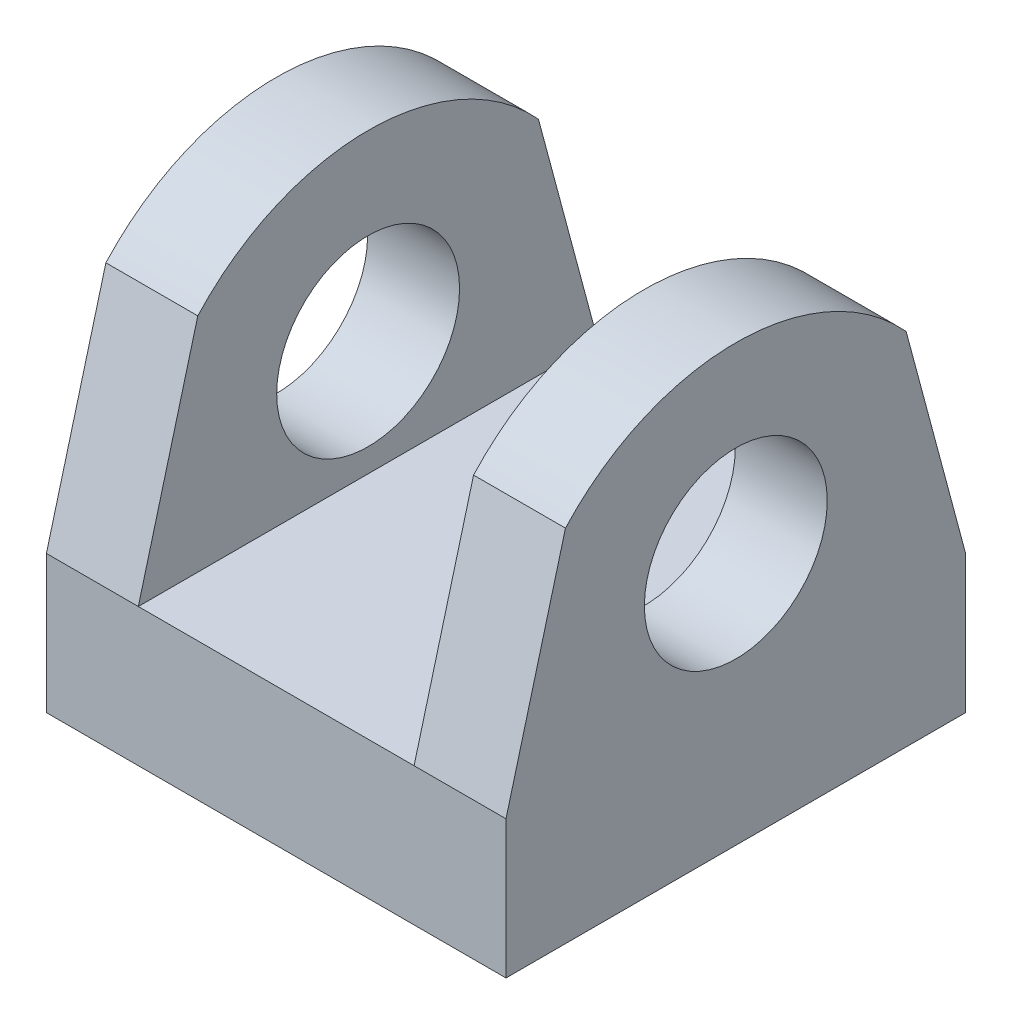
ISO-10303-21;
HEADER;
FILE_DESCRIPTION(('STEP AP214'),'2;1');
FILE_NAME('part.step','',(''),(''),'','','');
FILE_SCHEMA(('AUTOMOTIVE_DESIGN { 1 0 10303 214 1 1 1 1 }'));
ENDSEC;
DATA;
#1=APPLICATION_CONTEXT('core data for automotive mechanical design processes');
#2=APPLICATION_PROTOCOL_DEFINITION('international standard','automotive_design',2000,#1);
#3=PRODUCT_CONTEXT('',#1,'mechanical');
#4=PRODUCT('Part','Part','',(#3));
#5=PRODUCT_RELATED_PRODUCT_CATEGORY('part','',(#4));
#6=PRODUCT_DEFINITION_FORMATION('','',#4);
#7=PRODUCT_DEFINITION_CONTEXT('part definition',#1,'design');
#8=PRODUCT_DEFINITION('design','',#6,#7);
#9=PRODUCT_DEFINITION_SHAPE('','',#8);
#10=(LENGTH_UNIT() NAMED_UNIT(*) SI_UNIT(.MILLI.,.METRE.));
#11=(NAMED_UNIT(*) PLANE_ANGLE_UNIT() SI_UNIT($,.RADIAN.));
#12=(NAMED_UNIT(*) SI_UNIT($,.STERADIAN.) SOLID_ANGLE_UNIT());
#13=UNCERTAINTY_MEASURE_WITH_UNIT(LENGTH_MEASURE(1.E-05),#10,'distance_accuracy_value','');
#14=(GEOMETRIC_REPRESENTATION_CONTEXT(3) GLOBAL_UNCERTAINTY_ASSIGNED_CONTEXT((#13)) GLOBAL_UNIT_ASSIGNED_CONTEXT((#10,
#11,#12)) REPRESENTATION_CONTEXT('',''));
#15=CARTESIAN_POINT('',(0.,0.,0.));
#16=DIRECTION('',(0.,0.,1.));
#17=DIRECTION('',(1.,0.,0.));
#18=AXIS2_PLACEMENT_3D('',#15,#16,#17);
#19=CARTESIAN_POINT('',(12.7,7.62,12.7));
#20=DIRECTION('',(-1.,0.,0.));
#21=DIRECTION('',(0.,0.,1.));
#22=AXIS2_PLACEMENT_3D('',#19,#20,#21);
#23=PLANE('',#22);
#24=CARTESIAN_POINT('',(12.7,13.97,0.));
#25=DIRECTION('',(1.,0.,0.));
#26=DIRECTION('',(0.,0.,-1.));
#27=AXIS2_PLACEMENT_3D('',#24,#25,#26);
#28=CIRCLE('',#27,5.05316944316768);
#29=CARTESIAN_POINT('',(12.7,13.97,-5.05316944316768));
#30=VERTEX_POINT('',#29);
#31=EDGE_CURVE('E245',#30,#30,#28,.T.);
#32=ORIENTED_EDGE('',*,*,#31,.F.);
#33=EDGE_LOOP('',(#32));
#34=FACE_BOUND('',#33,.T.);
#35=DIRECTION('',(0.,0.,-1.));
#36=VECTOR('',#35,1.);
#37=CARTESIAN_POINT('',(12.7,0.,12.7));
#38=LINE('',#37,#36);
#39=CARTESIAN_POINT('',(12.7,0.,12.7));
#40=VERTEX_POINT('',#39);
#41=CARTESIAN_POINT('',(12.7,0.,-12.7));
#42=VERTEX_POINT('',#41);
#43=EDGE_CURVE('E172',#40,#42,#38,.T.);
#44=ORIENTED_EDGE('',*,*,#43,.T.);
#45=DIRECTION('',(0.,-1.,0.));
#46=VECTOR('',#45,1.);
#47=CARTESIAN_POINT('',(12.7,7.62,-12.7));
#48=LINE('',#47,#46);
#49=CARTESIAN_POINT('',(12.7,7.62,-12.7));
#50=VERTEX_POINT('',#49);
#51=EDGE_CURVE('E11',#50,#42,#48,.T.);
#52=ORIENTED_EDGE('',*,*,#51,.F.);
#53=DIRECTION('',(0.,0.965925826289067,0.258819045102525));
#54=VECTOR('',#53,1.);
#55=CARTESIAN_POINT('',(12.7,7.62,-12.7));
#56=LINE('',#55,#54);
#57=CARTESIAN_POINT('',(12.7,19.8872579938712,-9.41299812719793));
#58=VERTEX_POINT('',#57);
#59=EDGE_CURVE('E147',#50,#58,#56,.T.);
#60=ORIENTED_EDGE('',*,*,#59,.T.);
#61=CARTESIAN_POINT('',(12.7,11.3461568597658,0.));
#62=DIRECTION('',(1.,0.,0.));
#63=DIRECTION('',(0.,0.,1.));
#64=AXIS2_PLACEMENT_3D('',#61,#62,#63);
#65=CIRCLE('',#64,12.7104265202097);
#66=CARTESIAN_POINT('',(12.7,19.8872579938712,9.41299812719802));
#67=VERTEX_POINT('',#66);
#68=EDGE_CURVE('E165',#58,#67,#65,.T.);
#69=ORIENTED_EDGE('',*,*,#68,.T.);
#70=DIRECTION('',(0.,-0.965925826289069,0.258819045102518));
#71=VECTOR('',#70,1.);
#72=CARTESIAN_POINT('',(12.7,7.62,12.7));
#73=LINE('',#72,#71);
#74=CARTESIAN_POINT('',(12.7,7.62,12.7));
#75=VERTEX_POINT('',#74);
#76=EDGE_CURVE('E153',#67,#75,#73,.T.);
#77=ORIENTED_EDGE('',*,*,#76,.T.);
#78=DIRECTION('',(0.,-1.,0.));
#79=VECTOR('',#78,1.);
#80=CARTESIAN_POINT('',(12.7,7.62,12.7));
#81=LINE('',#80,#79);
#82=EDGE_CURVE('E182',#75,#40,#81,.T.);
#83=ORIENTED_EDGE('',*,*,#82,.T.);
#84=EDGE_LOOP('',(#44,#52,#60,#69,#77,#83));
#85=FACE_BOUND('',#84,.T.);
#86=ADVANCED_FACE('F33',(#34,#85),#23,.F.);
#87=CARTESIAN_POINT('',(-12.7,7.62,-12.7));
#88=DIRECTION('',(0.,0.,1.));
#89=DIRECTION('',(1.,0.,0.));
#90=AXIS2_PLACEMENT_3D('',#87,#88,#89);
#91=PLANE('',#90);
#92=DIRECTION('',(-1.,0.,0.));
#93=VECTOR('',#92,1.);
#94=CARTESIAN_POINT('',(-12.7,0.,-12.7));
#95=LINE('',#94,#93);
#96=CARTESIAN_POINT('',(-12.7,0.,-12.7));
#97=VERTEX_POINT('',#96);
#98=EDGE_CURVE('E185',#42,#97,#95,.T.);
#99=ORIENTED_EDGE('',*,*,#98,.T.);
#100=DIRECTION('',(0.,-1.,0.));
#101=VECTOR('',#100,1.);
#102=CARTESIAN_POINT('',(-12.7,7.62,-12.7));
#103=LINE('',#102,#101);
#104=CARTESIAN_POINT('',(-12.7,7.62,-12.7));
#105=VERTEX_POINT('',#104);
#106=EDGE_CURVE('E41',#105,#97,#103,.T.);
#107=ORIENTED_EDGE('',*,*,#106,.F.);
#108=DIRECTION('',(-1.,0.,0.));
#109=VECTOR('',#108,1.);
#110=CARTESIAN_POINT('',(-7.62,7.62,-12.7));
#111=LINE('',#110,#109);
#112=CARTESIAN_POINT('',(-7.62,7.62,-12.7));
#113=VERTEX_POINT('',#112);
#114=EDGE_CURVE('E48',#113,#105,#111,.T.);
#115=ORIENTED_EDGE('',*,*,#114,.F.);
#116=DIRECTION('',(-1.,0.,0.));
#117=VECTOR('',#116,1.);
#118=CARTESIAN_POINT('',(-12.7,7.62,-12.7));
#119=LINE('',#118,#117);
#120=CARTESIAN_POINT('',(7.62,7.62,-12.7));
#121=VERTEX_POINT('',#120);
#122=EDGE_CURVE('E180',#121,#113,#119,.T.);
#123=ORIENTED_EDGE('',*,*,#122,.F.);
#124=EDGE_CURVE('E176',#50,#121,#119,.T.);
#125=ORIENTED_EDGE('',*,*,#124,.F.);
#126=ORIENTED_EDGE('',*,*,#51,.T.);
#127=EDGE_LOOP('',(#99,#107,#115,#123,#125,#126));
#128=FACE_BOUND('',#127,.T.);
#129=ADVANCED_FACE('F225',(#128),#91,.F.);
#130=CARTESIAN_POINT('',(-12.7,7.62,12.7));
#131=DIRECTION('',(1.,0.,0.));
#132=DIRECTION('',(0.,0.,-1.));
#133=AXIS2_PLACEMENT_3D('',#130,#131,#132);
#134=PLANE('',#133);
#135=CARTESIAN_POINT('',(-12.7,13.97,0.));
#136=DIRECTION('',(1.,0.,0.));
#137=DIRECTION('',(0.,0.,-1.));
#138=AXIS2_PLACEMENT_3D('',#135,#136,#137);
#139=CIRCLE('',#138,5.05316944316768);
#140=CARTESIAN_POINT('',(-12.7,13.97,-5.05316944316768));
#141=VERTEX_POINT('',#140);
#142=EDGE_CURVE('E247',#141,#141,#139,.T.);
#143=ORIENTED_EDGE('',*,*,#142,.T.);
#144=EDGE_LOOP('',(#143));
#145=FACE_BOUND('',#144,.T.);
#146=DIRECTION('',(0.,0.,1.));
#147=VECTOR('',#146,1.);
#148=CARTESIAN_POINT('',(-12.7,0.,12.7));
#149=LINE('',#148,#147);
#150=CARTESIAN_POINT('',(-12.7,0.,12.7));
#151=VERTEX_POINT('',#150);
#152=EDGE_CURVE('E187',#97,#151,#149,.T.);
#153=ORIENTED_EDGE('',*,*,#152,.T.);
#154=DIRECTION('',(0.,-1.,0.));
#155=VECTOR('',#154,1.);
#156=CARTESIAN_POINT('',(-12.7,7.62,12.7));
#157=LINE('',#156,#155);
#158=CARTESIAN_POINT('',(-12.7,7.62,12.7));
#159=VERTEX_POINT('',#158);
#160=EDGE_CURVE('E193',#159,#151,#157,.T.);
#161=ORIENTED_EDGE('',*,*,#160,.F.);
#162=DIRECTION('',(0.,-0.965925826289069,0.258819045102518));
#163=VECTOR('',#162,1.);
#164=CARTESIAN_POINT('',(-12.7,7.62,12.7));
#165=LINE('',#164,#163);
#166=CARTESIAN_POINT('',(-12.7,19.8872579938712,9.41299812719802));
#167=VERTEX_POINT('',#166);
#168=EDGE_CURVE('E141',#167,#159,#165,.T.);
#169=ORIENTED_EDGE('',*,*,#168,.F.);
#170=CARTESIAN_POINT('',(-12.7,11.3461568597658,0.));
#171=DIRECTION('',(1.,0.,0.));
#172=DIRECTION('',(0.,0.,1.));
#173=AXIS2_PLACEMENT_3D('',#170,#171,#172);
#174=CIRCLE('',#173,12.7104265202097);
#175=CARTESIAN_POINT('',(-12.7,19.8872579938712,-9.41299812719793));
#176=VERTEX_POINT('',#175);
#177=EDGE_CURVE('E127',#176,#167,#174,.T.);
#178=ORIENTED_EDGE('',*,*,#177,.F.);
#179=DIRECTION('',(0.,0.965925826289067,0.258819045102525));
#180=VECTOR('',#179,1.);
#181=CARTESIAN_POINT('',(-12.7,7.62,-12.7));
#182=LINE('',#181,#180);
#183=EDGE_CURVE('E136',#105,#176,#182,.T.);
#184=ORIENTED_EDGE('',*,*,#183,.F.);
#185=ORIENTED_EDGE('',*,*,#106,.T.);
#186=EDGE_LOOP('',(#153,#161,#169,#178,#184,#185));
#187=FACE_BOUND('',#186,.T.);
#188=ADVANCED_FACE('F200',(#145,#187),#134,.F.);
#189=CARTESIAN_POINT('',(-12.7,7.62,12.7));
#190=DIRECTION('',(0.,0.,-1.));
#191=DIRECTION('',(-1.,0.,0.));
#192=AXIS2_PLACEMENT_3D('',#189,#190,#191);
#193=PLANE('',#192);
#194=DIRECTION('',(1.,0.,0.));
#195=VECTOR('',#194,1.);
#196=CARTESIAN_POINT('',(-12.7,0.,12.7));
#197=LINE('',#196,#195);
#198=EDGE_CURVE('E189',#151,#40,#197,.T.);
#199=ORIENTED_EDGE('',*,*,#198,.T.);
#200=ORIENTED_EDGE('',*,*,#82,.F.);
#201=DIRECTION('',(1.,0.,0.));
#202=VECTOR('',#201,1.);
#203=CARTESIAN_POINT('',(7.62,7.62,12.7));
#204=LINE('',#203,#202);
#205=CARTESIAN_POINT('',(7.62,7.62,12.7));
#206=VERTEX_POINT('',#205);
#207=EDGE_CURVE('E170',#206,#75,#204,.T.);
#208=ORIENTED_EDGE('',*,*,#207,.F.);
#209=DIRECTION('',(1.,0.,0.));
#210=VECTOR('',#209,1.);
#211=CARTESIAN_POINT('',(-12.7,7.62,12.7));
#212=LINE('',#211,#210);
#213=CARTESIAN_POINT('',(-7.62,7.62,12.7));
#214=VERTEX_POINT('',#213);
#215=EDGE_CURVE('E179',#214,#206,#212,.T.);
#216=ORIENTED_EDGE('',*,*,#215,.F.);
#217=EDGE_CURVE('E134',#159,#214,#212,.T.);
#218=ORIENTED_EDGE('',*,*,#217,.F.);
#219=ORIENTED_EDGE('',*,*,#160,.T.);
#220=EDGE_LOOP('',(#199,#200,#208,#216,#218,#219));
#221=FACE_BOUND('',#220,.T.);
#222=ADVANCED_FACE('F208',(#221),#193,.F.);
#223=CARTESIAN_POINT('',(0.,7.62,0.));
#224=DIRECTION('',(0.,-1.,0.));
#225=DIRECTION('',(0.,0.,-1.));
#226=AXIS2_PLACEMENT_3D('',#223,#224,#225);
#227=PLANE('',#226);
#228=ORIENTED_EDGE('',*,*,#122,.T.);
#229=DIRECTION('',(0.,0.,-1.));
#230=VECTOR('',#229,1.);
#231=CARTESIAN_POINT('',(-7.62,7.62,12.7));
#232=LINE('',#231,#230);
#233=EDGE_CURVE('E55',#214,#113,#232,.T.);
#234=ORIENTED_EDGE('',*,*,#233,.F.);
#235=ORIENTED_EDGE('',*,*,#215,.T.);
#236=DIRECTION('',(0.,0.,-1.));
#237=VECTOR('',#236,1.);
#238=CARTESIAN_POINT('',(7.62,7.62,12.7));
#239=LINE('',#238,#237);
#240=EDGE_CURVE('E149',#206,#121,#239,.T.);
#241=ORIENTED_EDGE('',*,*,#240,.T.);
#242=EDGE_LOOP('',(#228,#234,#235,#241));
#243=FACE_BOUND('',#242,.T.);
#244=ADVANCED_FACE('F218',(#243),#227,.F.);
#245=CARTESIAN_POINT('',(0.,0.,0.));
#246=DIRECTION('',(0.,-1.,0.));
#247=DIRECTION('',(0.,0.,-1.));
#248=AXIS2_PLACEMENT_3D('',#245,#246,#247);
#249=PLANE('',#248);
#250=ORIENTED_EDGE('',*,*,#43,.F.);
#251=ORIENTED_EDGE('',*,*,#198,.F.);
#252=ORIENTED_EDGE('',*,*,#152,.F.);
#253=ORIENTED_EDGE('',*,*,#98,.F.);
#254=EDGE_LOOP('',(#250,#251,#252,#253));
#255=FACE_BOUND('',#254,.T.);
#256=ADVANCED_FACE('F205',(#255),#249,.T.);
#257=CARTESIAN_POINT('',(7.62,7.62,12.7));
#258=DIRECTION('',(0.,0.258819045102518,0.965925826289069));
#259=DIRECTION('',(0.,-0.965925826289069,0.258819045102518));
#260=AXIS2_PLACEMENT_3D('',#257,#258,#259);
#261=PLANE('',#260);
#262=ORIENTED_EDGE('',*,*,#76,.F.);
#263=DIRECTION('',(1.,0.,0.));
#264=VECTOR('',#263,1.);
#265=CARTESIAN_POINT('',(7.62,19.8872579938712,9.41299812719802));
#266=LINE('',#265,#264);
#267=CARTESIAN_POINT('',(7.62,19.8872579938712,9.41299812719802));
#268=VERTEX_POINT('',#267);
#269=EDGE_CURVE('E173',#268,#67,#266,.T.);
#270=ORIENTED_EDGE('',*,*,#269,.F.);
#271=DIRECTION('',(0.,-0.965925826289069,0.258819045102518));
#272=VECTOR('',#271,1.);
#273=CARTESIAN_POINT('',(7.62,7.62,12.7));
#274=LINE('',#273,#272);
#275=EDGE_CURVE('E159',#268,#206,#274,.T.);
#276=ORIENTED_EDGE('',*,*,#275,.T.);
#277=ORIENTED_EDGE('',*,*,#207,.T.);
#278=EDGE_LOOP('',(#262,#270,#276,#277));
#279=FACE_BOUND('',#278,.T.);
#280=ADVANCED_FACE('F215',(#279),#261,.T.);
#281=CARTESIAN_POINT('',(7.62,11.3461568597658,0.));
#282=DIRECTION('',(1.,0.,0.));
#283=DIRECTION('',(0.,0.,-1.));
#284=AXIS2_PLACEMENT_3D('',#281,#282,#283);
#285=CYLINDRICAL_SURFACE('',#284,12.7104265202097);
#286=ORIENTED_EDGE('',*,*,#68,.F.);
#287=DIRECTION('',(1.,0.,0.));
#288=VECTOR('',#287,1.);
#289=CARTESIAN_POINT('',(7.62,19.8872579938712,-9.41299812719793));
#290=LINE('',#289,#288);
#291=CARTESIAN_POINT('',(7.62,19.8872579938712,-9.41299812719793));
#292=VERTEX_POINT('',#291);
#293=EDGE_CURVE('E162',#292,#58,#290,.T.);
#294=ORIENTED_EDGE('',*,*,#293,.F.);
#295=CARTESIAN_POINT('',(7.62,11.3461568597658,0.));
#296=DIRECTION('',(1.,0.,0.));
#297=DIRECTION('',(0.,0.,1.));
#298=AXIS2_PLACEMENT_3D('',#295,#296,#297);
#299=CIRCLE('',#298,12.7104265202097);
#300=EDGE_CURVE('E156',#292,#268,#299,.T.);
#301=ORIENTED_EDGE('',*,*,#300,.T.);
#302=ORIENTED_EDGE('',*,*,#269,.T.);
#303=EDGE_LOOP('',(#286,#294,#301,#302));
#304=FACE_BOUND('',#303,.T.);
#305=ADVANCED_FACE('F273',(#304),#285,.T.);
#306=CARTESIAN_POINT('',(7.62,7.62,-12.7));
#307=DIRECTION('',(0.,0.258819045102525,-0.965925826289067));
#308=DIRECTION('',(0.,0.965925826289067,0.258819045102525));
#309=AXIS2_PLACEMENT_3D('',#306,#307,#308);
#310=PLANE('',#309);
#311=ORIENTED_EDGE('',*,*,#59,.F.);
#312=ORIENTED_EDGE('',*,*,#124,.T.);
#313=DIRECTION('',(0.,0.965925826289067,0.258819045102525));
#314=VECTOR('',#313,1.);
#315=CARTESIAN_POINT('',(7.62,7.62,-12.7));
#316=LINE('',#315,#314);
#317=EDGE_CURVE('E152',#121,#292,#316,.T.);
#318=ORIENTED_EDGE('',*,*,#317,.T.);
#319=ORIENTED_EDGE('',*,*,#293,.T.);
#320=EDGE_LOOP('',(#311,#312,#318,#319));
#321=FACE_BOUND('',#320,.T.);
#322=ADVANCED_FACE('F224',(#321),#310,.T.);
#323=CARTESIAN_POINT('',(7.62,11.3461568597658,0.));
#324=DIRECTION('',(-1.,0.,0.));
#325=DIRECTION('',(0.,0.,1.));
#326=AXIS2_PLACEMENT_3D('',#323,#324,#325);
#327=PLANE('',#326);
#328=CARTESIAN_POINT('',(7.62,13.97,0.));
#329=DIRECTION('',(-1.,0.,0.));
#330=DIRECTION('',(0.,0.,1.));
#331=AXIS2_PLACEMENT_3D('',#328,#329,#330);
#332=CIRCLE('',#331,5.05316944316768);
#333=CARTESIAN_POINT('',(7.62,13.97,5.05316944316768));
#334=VERTEX_POINT('',#333);
#335=EDGE_CURVE('E143',#334,#334,#332,.T.);
#336=ORIENTED_EDGE('',*,*,#335,.F.);
#337=EDGE_LOOP('',(#336));
#338=FACE_BOUND('',#337,.T.);
#339=ORIENTED_EDGE('',*,*,#240,.F.);
#340=ORIENTED_EDGE('',*,*,#275,.F.);
#341=ORIENTED_EDGE('',*,*,#300,.F.);
#342=ORIENTED_EDGE('',*,*,#317,.F.);
#343=EDGE_LOOP('',(#339,#340,#341,#342));
#344=FACE_BOUND('',#343,.T.);
#345=ADVANCED_FACE('F220',(#338,#344),#327,.T.);
#346=CARTESIAN_POINT('',(-7.62,7.62,-12.7));
#347=DIRECTION('',(0.,-0.258819045102525,0.965925826289067));
#348=DIRECTION('',(0.,-0.965925826289067,-0.258819045102525));
#349=AXIS2_PLACEMENT_3D('',#346,#347,#348);
#350=PLANE('',#349);
#351=ORIENTED_EDGE('',*,*,#183,.T.);
#352=DIRECTION('',(-1.,0.,0.));
#353=VECTOR('',#352,1.);
#354=CARTESIAN_POINT('',(-7.62,19.8872579938712,-9.41299812719793));
#355=LINE('',#354,#353);
#356=CARTESIAN_POINT('',(-7.62,19.8872579938712,-9.41299812719793));
#357=VERTEX_POINT('',#356);
#358=EDGE_CURVE('E131',#357,#176,#355,.T.);
#359=ORIENTED_EDGE('',*,*,#358,.F.);
#360=DIRECTION('',(0.,0.965925826289067,0.258819045102525));
#361=VECTOR('',#360,1.);
#362=CARTESIAN_POINT('',(-7.62,7.62,-12.7));
#363=LINE('',#362,#361);
#364=EDGE_CURVE('E118',#113,#357,#363,.T.);
#365=ORIENTED_EDGE('',*,*,#364,.F.);
#366=ORIENTED_EDGE('',*,*,#114,.T.);
#367=EDGE_LOOP('',(#351,#359,#365,#366));
#368=FACE_BOUND('',#367,.T.);
#369=ADVANCED_FACE('F227',(#368),#350,.F.);
#370=CARTESIAN_POINT('',(-7.62,11.3461568597658,0.));
#371=DIRECTION('',(-1.,0.,0.));
#372=DIRECTION('',(0.,0.,1.));
#373=AXIS2_PLACEMENT_3D('',#370,#371,#372);
#374=CYLINDRICAL_SURFACE('',#373,12.7104265202097);
#375=ORIENTED_EDGE('',*,*,#177,.T.);
#376=DIRECTION('',(-1.,0.,0.));
#377=VECTOR('',#376,1.);
#378=CARTESIAN_POINT('',(-7.62,19.8872579938712,9.41299812719802));
#379=LINE('',#378,#377);
#380=CARTESIAN_POINT('',(-7.62,19.8872579938712,9.41299812719802));
#381=VERTEX_POINT('',#380);
#382=EDGE_CURVE('E124',#381,#167,#379,.T.);
#383=ORIENTED_EDGE('',*,*,#382,.F.);
#384=CARTESIAN_POINT('',(-7.62,11.3461568597658,0.));
#385=DIRECTION('',(1.,0.,0.));
#386=DIRECTION('',(0.,0.,1.));
#387=AXIS2_PLACEMENT_3D('',#384,#385,#386);
#388=CIRCLE('',#387,12.7104265202097);
#389=EDGE_CURVE('E111',#357,#381,#388,.T.);
#390=ORIENTED_EDGE('',*,*,#389,.F.);
#391=ORIENTED_EDGE('',*,*,#358,.T.);
#392=EDGE_LOOP('',(#375,#383,#390,#391));
#393=FACE_BOUND('',#392,.T.);
#394=ADVANCED_FACE('F125',(#393),#374,.T.);
#395=CARTESIAN_POINT('',(-7.62,7.62,12.7));
#396=DIRECTION('',(0.,-0.258819045102518,-0.965925826289069));
#397=DIRECTION('',(0.,0.965925826289069,-0.258819045102518));
#398=AXIS2_PLACEMENT_3D('',#395,#396,#397);
#399=PLANE('',#398);
#400=ORIENTED_EDGE('',*,*,#168,.T.);
#401=ORIENTED_EDGE('',*,*,#217,.T.);
#402=DIRECTION('',(0.,-0.965925826289069,0.258819045102518));
#403=VECTOR('',#402,1.);
#404=CARTESIAN_POINT('',(-7.62,7.62,12.7));
#405=LINE('',#404,#403);
#406=EDGE_CURVE('E115',#381,#214,#405,.T.);
#407=ORIENTED_EDGE('',*,*,#406,.F.);
#408=ORIENTED_EDGE('',*,*,#382,.T.);
#409=EDGE_LOOP('',(#400,#401,#407,#408));
#410=FACE_BOUND('',#409,.T.);
#411=ADVANCED_FACE('F133',(#410),#399,.F.);
#412=CARTESIAN_POINT('',(-7.62,11.3461568597658,0.));
#413=DIRECTION('',(1.,0.,0.));
#414=DIRECTION('',(0.,0.,1.));
#415=AXIS2_PLACEMENT_3D('',#412,#413,#414);
#416=PLANE('',#415);
#417=CARTESIAN_POINT('',(-7.62,13.97,0.));
#418=DIRECTION('',(1.,0.,0.));
#419=DIRECTION('',(0.,0.,-1.));
#420=AXIS2_PLACEMENT_3D('',#417,#418,#419);
#421=CIRCLE('',#420,5.05316944316768);
#422=CARTESIAN_POINT('',(-7.62,13.97,-5.05316944316768));
#423=VERTEX_POINT('',#422);
#424=EDGE_CURVE('E36',#423,#423,#421,.T.);
#425=ORIENTED_EDGE('',*,*,#424,.F.);
#426=EDGE_LOOP('',(#425));
#427=FACE_BOUND('',#426,.T.);
#428=ORIENTED_EDGE('',*,*,#233,.T.);
#429=ORIENTED_EDGE('',*,*,#364,.T.);
#430=ORIENTED_EDGE('',*,*,#389,.T.);
#431=ORIENTED_EDGE('',*,*,#406,.T.);
#432=EDGE_LOOP('',(#428,#429,#430,#431));
#433=FACE_BOUND('',#432,.T.);
#434=ADVANCED_FACE('F113',(#427,#433),#416,.T.);
#435=CARTESIAN_POINT('',(-12.7,13.97,0.));
#436=DIRECTION('',(1.,0.,0.));
#437=DIRECTION('',(0.,0.,-1.));
#438=AXIS2_PLACEMENT_3D('',#435,#436,#437);
#439=CYLINDRICAL_SURFACE('',#438,5.05316944316768);
#440=ORIENTED_EDGE('',*,*,#424,.T.);
#441=EDGE_LOOP('',(#440));
#442=FACE_BOUND('',#441,.T.);
#443=ORIENTED_EDGE('',*,*,#142,.F.);
#444=EDGE_LOOP('',(#443));
#445=FACE_BOUND('',#444,.T.);
#446=ADVANCED_FACE('F257',(#442,#445),#439,.F.);
#447=ORIENTED_EDGE('',*,*,#335,.T.);
#448=EDGE_LOOP('',(#447));
#449=FACE_BOUND('',#448,.T.);
#450=ORIENTED_EDGE('',*,*,#31,.T.);
#451=EDGE_LOOP('',(#450));
#452=FACE_BOUND('',#451,.T.);
#453=ADVANCED_FACE('F265',(#449,#452),#439,.F.);
#454=CLOSED_SHELL('',(#86,#129,#188,#222,#244,#256,#280,#305,#322,#345,#369,#394,#411,#434,#446,#453));
#455=MANIFOLD_SOLID_BREP('B2',#454);
#456=ADVANCED_BREP_SHAPE_REPRESENTATION('',(#18,#455),#14);
#457=SHAPE_DEFINITION_REPRESENTATION(#9,#456);
ENDSEC;
END-ISO-10303-21;
